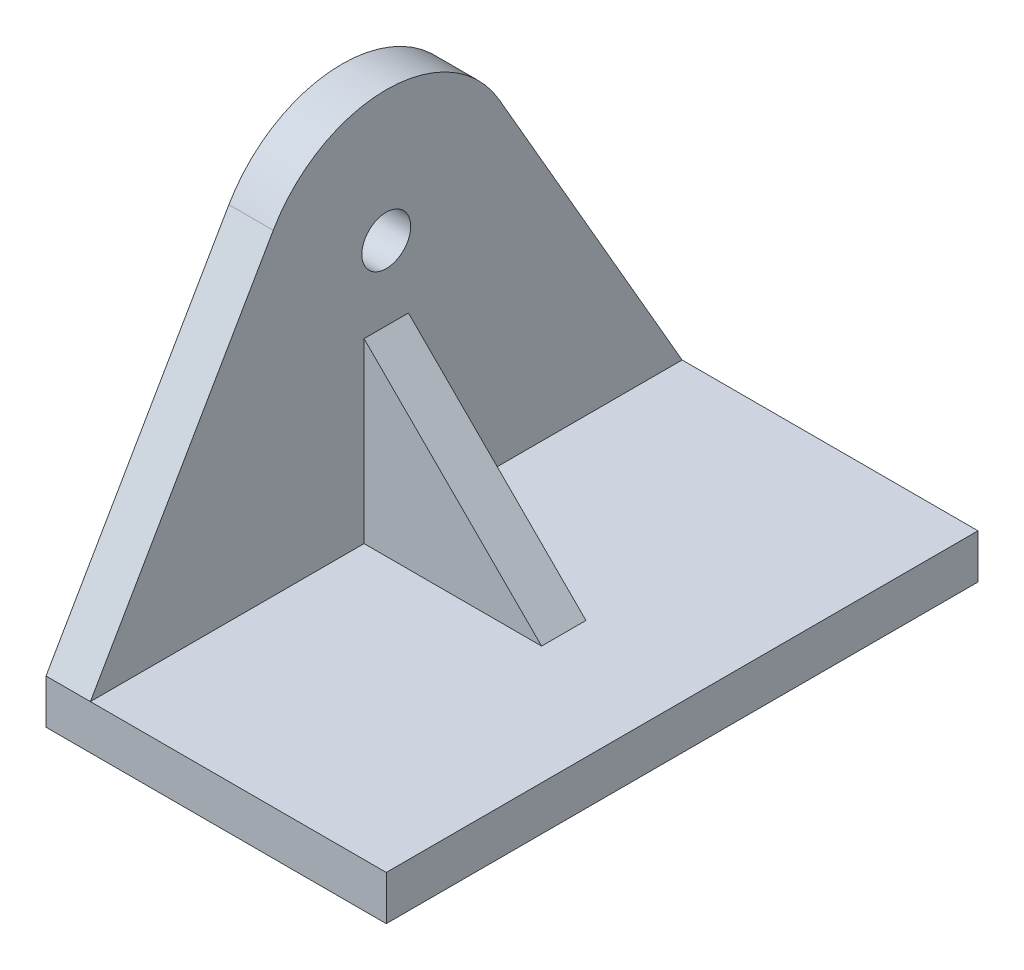
ISO-10303-21;
HEADER;
FILE_DESCRIPTION(('STEP AP214'),'2;1');
FILE_NAME('part.step','',(''),(''),'','','');
FILE_SCHEMA(('AUTOMOTIVE_DESIGN { 1 0 10303 214 1 1 1 1 }'));
ENDSEC;
DATA;
#1=APPLICATION_CONTEXT('core data for automotive mechanical design processes');
#2=APPLICATION_PROTOCOL_DEFINITION('international standard','automotive_design',2000,#1);
#3=PRODUCT_CONTEXT('',#1,'mechanical');
#4=PRODUCT('Part','Part','',(#3));
#5=PRODUCT_RELATED_PRODUCT_CATEGORY('part','',(#4));
#6=PRODUCT_DEFINITION_FORMATION('','',#4);
#7=PRODUCT_DEFINITION_CONTEXT('part definition',#1,'design');
#8=PRODUCT_DEFINITION('design','',#6,#7);
#9=PRODUCT_DEFINITION_SHAPE('','',#8);
#10=(LENGTH_UNIT() NAMED_UNIT(*) SI_UNIT(.MILLI.,.METRE.));
#11=(NAMED_UNIT(*) PLANE_ANGLE_UNIT() SI_UNIT($,.RADIAN.));
#12=(NAMED_UNIT(*) SI_UNIT($,.STERADIAN.) SOLID_ANGLE_UNIT());
#13=UNCERTAINTY_MEASURE_WITH_UNIT(LENGTH_MEASURE(1.E-05),#10,'distance_accuracy_value','');
#14=(GEOMETRIC_REPRESENTATION_CONTEXT(3) GLOBAL_UNCERTAINTY_ASSIGNED_CONTEXT((#13)) GLOBAL_UNIT_ASSIGNED_CONTEXT((#10,
#11,#12)) REPRESENTATION_CONTEXT('',''));
#15=CARTESIAN_POINT('',(0.,0.,0.));
#16=DIRECTION('',(0.,0.,1.));
#17=DIRECTION('',(1.,0.,0.));
#18=AXIS2_PLACEMENT_3D('',#15,#16,#17);
#19=CARTESIAN_POINT('',(0.,20.,0.));
#20=DIRECTION('',(1.,0.,0.));
#21=DIRECTION('',(0.,0.,-1.));
#22=AXIS2_PLACEMENT_3D('',#19,#20,#21);
#23=PLANE('',#22);
#24=CARTESIAN_POINT('',(0.,20.,0.));
#25=DIRECTION('',(1.,0.,0.));
#26=DIRECTION('',(0.,0.,-1.));
#27=AXIS2_PLACEMENT_3D('',#24,#25,#26);
#28=CIRCLE('',#27,1.65);
#29=CARTESIAN_POINT('',(0.,20.,-1.65));
#30=VERTEX_POINT('',#29);
#31=EDGE_CURVE('E195',#30,#30,#28,.T.);
#32=ORIENTED_EDGE('',*,*,#31,.F.);
#33=EDGE_LOOP('',(#32));
#34=FACE_BOUND('',#33,.T.);
#35=DIRECTION('',(0.,0.,1.));
#36=VECTOR('',#35,1.);
#37=CARTESIAN_POINT('',(0.,3.,20.));
#38=LINE('',#37,#36);
#39=CARTESIAN_POINT('',(0.,3.,1.5));
#40=VERTEX_POINT('',#39);
#41=CARTESIAN_POINT('',(0.,3.,20.));
#42=VERTEX_POINT('',#41);
#43=EDGE_CURVE('E179',#40,#42,#38,.T.);
#44=ORIENTED_EDGE('',*,*,#43,.F.);
#45=DIRECTION('',(0.,-1.,0.));
#46=VECTOR('',#45,1.);
#47=CARTESIAN_POINT('',(0.,3.,1.5));
#48=LINE('',#47,#46);
#49=CARTESIAN_POINT('',(0.,15.,1.5));
#50=VERTEX_POINT('',#49);
#51=EDGE_CURVE('E232',#50,#40,#48,.T.);
#52=ORIENTED_EDGE('',*,*,#51,.F.);
#53=DIRECTION('',(0.,0.,-1.));
#54=VECTOR('',#53,1.);
#55=CARTESIAN_POINT('',(0.,15.,1.5));
#56=LINE('',#55,#54);
#57=CARTESIAN_POINT('',(0.,15.,-1.5));
#58=VERTEX_POINT('',#57);
#59=EDGE_CURVE('E228',#50,#58,#56,.T.);
#60=ORIENTED_EDGE('',*,*,#59,.T.);
#61=DIRECTION('',(0.,-1.,0.));
#62=VECTOR('',#61,1.);
#63=CARTESIAN_POINT('',(0.,3.,-1.5));
#64=LINE('',#63,#62);
#65=CARTESIAN_POINT('',(0.,3.,-1.5));
#66=VERTEX_POINT('',#65);
#67=EDGE_CURVE('E241',#58,#66,#64,.T.);
#68=ORIENTED_EDGE('',*,*,#67,.T.);
#69=CARTESIAN_POINT('',(0.,3.,-20.));
#70=VERTEX_POINT('',#69);
#71=EDGE_CURVE('E175',#70,#66,#38,.T.);
#72=ORIENTED_EDGE('',*,*,#71,.F.);
#73=DIRECTION('',(0.,0.86602540378444,0.499999999999998));
#74=VECTOR('',#73,1.);
#75=CARTESIAN_POINT('',(0.,3.,-20.));
#76=LINE('',#75,#74);
#77=CARTESIAN_POINT('',(0.,24.4102540378444,-7.63878406783236));
#78=VERTEX_POINT('',#77);
#79=EDGE_CURVE('E136',#70,#78,#76,.T.);
#80=ORIENTED_EDGE('',*,*,#79,.T.);
#81=CARTESIAN_POINT('',(0.,20.,0.));
#82=DIRECTION('',(1.,0.,0.));
#83=DIRECTION('',(0.,0.,-1.));
#84=AXIS2_PLACEMENT_3D('',#81,#82,#83);
#85=CIRCLE('',#84,8.82050807568884);
#86=CARTESIAN_POINT('',(0.,24.4102540378444,7.63878406783234));
#87=VERTEX_POINT('',#86);
#88=EDGE_CURVE('E106',#78,#87,#85,.T.);
#89=ORIENTED_EDGE('',*,*,#88,.T.);
#90=DIRECTION('',(0.,-0.86602540378444,0.499999999999998));
#91=VECTOR('',#90,1.);
#92=CARTESIAN_POINT('',(0.,3.,20.));
#93=LINE('',#92,#91);
#94=EDGE_CURVE('E142',#87,#42,#93,.T.);
#95=ORIENTED_EDGE('',*,*,#94,.T.);
#96=EDGE_LOOP('',(#44,#52,#60,#68,#72,#80,#89,#95));
#97=FACE_BOUND('',#96,.T.);
#98=ADVANCED_FACE('F39',(#34,#97),#23,.T.);
#99=CARTESIAN_POINT('',(20.,3.,20.));
#100=DIRECTION('',(0.,-1.,0.));
#101=DIRECTION('',(0.,0.,-1.));
#102=AXIS2_PLACEMENT_3D('',#99,#100,#101);
#103=PLANE('',#102);
#104=DIRECTION('',(1.,0.,0.));
#105=VECTOR('',#104,1.);
#106=CARTESIAN_POINT('',(12.,3.,1.5));
#107=LINE('',#106,#105);
#108=CARTESIAN_POINT('',(12.,3.,1.5));
#109=VERTEX_POINT('',#108);
#110=EDGE_CURVE('E233',#40,#109,#107,.T.);
#111=ORIENTED_EDGE('',*,*,#110,.F.);
#112=ORIENTED_EDGE('',*,*,#43,.T.);
#113=DIRECTION('',(-1.,0.,0.));
#114=VECTOR('',#113,1.);
#115=CARTESIAN_POINT('',(20.,3.,20.));
#116=LINE('',#115,#114);
#117=CARTESIAN_POINT('',(20.,3.,20.));
#118=VERTEX_POINT('',#117);
#119=EDGE_CURVE('E187',#118,#42,#116,.T.);
#120=ORIENTED_EDGE('',*,*,#119,.F.);
#121=DIRECTION('',(0.,0.,1.));
#122=VECTOR('',#121,1.);
#123=CARTESIAN_POINT('',(20.,3.,20.));
#124=LINE('',#123,#122);
#125=CARTESIAN_POINT('',(20.,3.,-20.));
#126=VERTEX_POINT('',#125);
#127=EDGE_CURVE('E172',#126,#118,#124,.T.);
#128=ORIENTED_EDGE('',*,*,#127,.F.);
#129=DIRECTION('',(-1.,0.,0.));
#130=VECTOR('',#129,1.);
#131=CARTESIAN_POINT('',(20.,3.,-20.));
#132=LINE('',#131,#130);
#133=EDGE_CURVE('E191',#126,#70,#132,.T.);
#134=ORIENTED_EDGE('',*,*,#133,.T.);
#135=ORIENTED_EDGE('',*,*,#71,.T.);
#136=DIRECTION('',(1.,0.,0.));
#137=VECTOR('',#136,1.);
#138=CARTESIAN_POINT('',(12.,3.,-1.5));
#139=LINE('',#138,#137);
#140=CARTESIAN_POINT('',(12.,3.,-1.5));
#141=VERTEX_POINT('',#140);
#142=EDGE_CURVE('E245',#66,#141,#139,.T.);
#143=ORIENTED_EDGE('',*,*,#142,.T.);
#144=DIRECTION('',(0.,0.,-1.));
#145=VECTOR('',#144,1.);
#146=CARTESIAN_POINT('',(12.,3.,1.5));
#147=LINE('',#146,#145);
#148=EDGE_CURVE('E57',#109,#141,#147,.T.);
#149=ORIENTED_EDGE('',*,*,#148,.F.);
#150=EDGE_LOOP('',(#111,#112,#120,#128,#134,#135,#143,#149));
#151=FACE_BOUND('',#150,.T.);
#152=ADVANCED_FACE('F244',(#151),#103,.F.);
#153=CARTESIAN_POINT('',(-3.,0.,20.));
#154=DIRECTION('',(0.,0.,1.));
#155=DIRECTION('',(1.,0.,0.));
#156=AXIS2_PLACEMENT_3D('',#153,#154,#155);
#157=PLANE('',#156);
#158=DIRECTION('',(1.,0.,0.));
#159=VECTOR('',#158,1.);
#160=CARTESIAN_POINT('',(-3.,0.,20.));
#161=LINE('',#160,#159);
#162=CARTESIAN_POINT('',(-3.,0.,20.));
#163=VERTEX_POINT('',#162);
#164=CARTESIAN_POINT('',(20.,0.,20.));
#165=VERTEX_POINT('',#164);
#166=EDGE_CURVE('E43',#163,#165,#161,.T.);
#167=ORIENTED_EDGE('',*,*,#166,.T.);
#168=DIRECTION('',(0.,-1.,0.));
#169=VECTOR('',#168,1.);
#170=CARTESIAN_POINT('',(20.,3.,20.));
#171=LINE('',#170,#169);
#172=EDGE_CURVE('E159',#118,#165,#171,.T.);
#173=ORIENTED_EDGE('',*,*,#172,.F.);
#174=ORIENTED_EDGE('',*,*,#119,.T.);
#175=DIRECTION('',(1.,0.,0.));
#176=VECTOR('',#175,1.);
#177=CARTESIAN_POINT('',(-3.,3.,20.));
#178=LINE('',#177,#176);
#179=CARTESIAN_POINT('',(-3.,3.,20.));
#180=VERTEX_POINT('',#179);
#181=EDGE_CURVE('E11',#180,#42,#178,.T.);
#182=ORIENTED_EDGE('',*,*,#181,.F.);
#183=DIRECTION('',(0.,-1.,0.));
#184=VECTOR('',#183,1.);
#185=CARTESIAN_POINT('',(-3.,0.,20.));
#186=LINE('',#185,#184);
#187=EDGE_CURVE('E145',#180,#163,#186,.T.);
#188=ORIENTED_EDGE('',*,*,#187,.T.);
#189=EDGE_LOOP('',(#167,#173,#174,#182,#188));
#190=FACE_BOUND('',#189,.T.);
#191=ADVANCED_FACE('F41',(#190),#157,.T.);
#192=CARTESIAN_POINT('',(-3.,3.,20.));
#193=DIRECTION('',(0.,0.499999999999998,0.86602540378444));
#194=DIRECTION('',(0.,-0.86602540378444,0.499999999999998));
#195=AXIS2_PLACEMENT_3D('',#192,#193,#194);
#196=PLANE('',#195);
#197=ORIENTED_EDGE('',*,*,#94,.F.);
#198=DIRECTION('',(1.,0.,0.));
#199=VECTOR('',#198,1.);
#200=CARTESIAN_POINT('',(-3.,24.4102540378444,7.63878406783234));
#201=LINE('',#200,#199);
#202=CARTESIAN_POINT('',(-3.,24.4102540378444,7.63878406783234));
#203=VERTEX_POINT('',#202);
#204=EDGE_CURVE('E49',#203,#87,#201,.T.);
#205=ORIENTED_EDGE('',*,*,#204,.F.);
#206=DIRECTION('',(0.,-0.86602540378444,0.499999999999998));
#207=VECTOR('',#206,1.);
#208=CARTESIAN_POINT('',(-3.,3.,20.));
#209=LINE('',#208,#207);
#210=EDGE_CURVE('E121',#203,#180,#209,.T.);
#211=ORIENTED_EDGE('',*,*,#210,.T.);
#212=ORIENTED_EDGE('',*,*,#181,.T.);
#213=EDGE_LOOP('',(#197,#205,#211,#212));
#214=FACE_BOUND('',#213,.T.);
#215=ADVANCED_FACE('F265',(#214),#196,.T.);
#216=CARTESIAN_POINT('',(-3.,20.,0.));
#217=DIRECTION('',(1.,0.,0.));
#218=DIRECTION('',(0.,0.,-1.));
#219=AXIS2_PLACEMENT_3D('',#216,#217,#218);
#220=CYLINDRICAL_SURFACE('',#219,8.82050807568884);
#221=ORIENTED_EDGE('',*,*,#88,.F.);
#222=DIRECTION('',(1.,0.,0.));
#223=VECTOR('',#222,1.);
#224=CARTESIAN_POINT('',(-3.,24.4102540378444,-7.63878406783236));
#225=LINE('',#224,#223);
#226=CARTESIAN_POINT('',(-3.,24.4102540378444,-7.63878406783236));
#227=VERTEX_POINT('',#226);
#228=EDGE_CURVE('E101',#227,#78,#225,.T.);
#229=ORIENTED_EDGE('',*,*,#228,.F.);
#230=CARTESIAN_POINT('',(-3.,20.,0.));
#231=DIRECTION('',(1.,0.,0.));
#232=DIRECTION('',(0.,0.,-1.));
#233=AXIS2_PLACEMENT_3D('',#230,#231,#232);
#234=CIRCLE('',#233,8.82050807568884);
#235=EDGE_CURVE('E104',#227,#203,#234,.T.);
#236=ORIENTED_EDGE('',*,*,#235,.T.);
#237=ORIENTED_EDGE('',*,*,#204,.T.);
#238=EDGE_LOOP('',(#221,#229,#236,#237));
#239=FACE_BOUND('',#238,.T.);
#240=ADVANCED_FACE('F103',(#239),#220,.T.);
#241=CARTESIAN_POINT('',(-3.,3.,-20.));
#242=DIRECTION('',(0.,0.499999999999998,-0.86602540378444));
#243=DIRECTION('',(0.,0.86602540378444,0.499999999999998));
#244=AXIS2_PLACEMENT_3D('',#241,#242,#243);
#245=PLANE('',#244);
#246=ORIENTED_EDGE('',*,*,#79,.F.);
#247=DIRECTION('',(1.,0.,0.));
#248=VECTOR('',#247,1.);
#249=CARTESIAN_POINT('',(-3.,3.,-20.));
#250=LINE('',#249,#248);
#251=CARTESIAN_POINT('',(-3.,3.,-20.));
#252=VERTEX_POINT('',#251);
#253=EDGE_CURVE('E112',#252,#70,#250,.T.);
#254=ORIENTED_EDGE('',*,*,#253,.F.);
#255=DIRECTION('',(0.,0.86602540378444,0.499999999999998));
#256=VECTOR('',#255,1.);
#257=CARTESIAN_POINT('',(-3.,3.,-20.));
#258=LINE('',#257,#256);
#259=EDGE_CURVE('E118',#252,#227,#258,.T.);
#260=ORIENTED_EDGE('',*,*,#259,.T.);
#261=ORIENTED_EDGE('',*,*,#228,.T.);
#262=EDGE_LOOP('',(#246,#254,#260,#261));
#263=FACE_BOUND('',#262,.T.);
#264=ADVANCED_FACE('F124',(#263),#245,.T.);
#265=CARTESIAN_POINT('',(-3.,0.,-20.));
#266=DIRECTION('',(0.,0.,-1.));
#267=DIRECTION('',(-1.,0.,0.));
#268=AXIS2_PLACEMENT_3D('',#265,#266,#267);
#269=PLANE('',#268);
#270=ORIENTED_EDGE('',*,*,#253,.T.);
#271=ORIENTED_EDGE('',*,*,#133,.F.);
#272=DIRECTION('',(0.,1.,0.));
#273=VECTOR('',#272,1.);
#274=CARTESIAN_POINT('',(20.,3.,-20.));
#275=LINE('',#274,#273);
#276=CARTESIAN_POINT('',(20.,0.,-20.));
#277=VERTEX_POINT('',#276);
#278=EDGE_CURVE('E167',#277,#126,#275,.T.);
#279=ORIENTED_EDGE('',*,*,#278,.F.);
#280=DIRECTION('',(1.,0.,0.));
#281=VECTOR('',#280,1.);
#282=CARTESIAN_POINT('',(-3.,0.,-20.));
#283=LINE('',#282,#281);
#284=CARTESIAN_POINT('',(-3.,0.,-20.));
#285=VERTEX_POINT('',#284);
#286=EDGE_CURVE('E150',#285,#277,#283,.T.);
#287=ORIENTED_EDGE('',*,*,#286,.F.);
#288=DIRECTION('',(0.,1.,0.));
#289=VECTOR('',#288,1.);
#290=CARTESIAN_POINT('',(-3.,0.,-20.));
#291=LINE('',#290,#289);
#292=EDGE_CURVE('E127',#285,#252,#291,.T.);
#293=ORIENTED_EDGE('',*,*,#292,.T.);
#294=EDGE_LOOP('',(#270,#271,#279,#287,#293));
#295=FACE_BOUND('',#294,.T.);
#296=ADVANCED_FACE('F205',(#295),#269,.T.);
#297=CARTESIAN_POINT('',(-3.,0.,20.));
#298=DIRECTION('',(0.,-1.,0.));
#299=DIRECTION('',(0.,0.,-1.));
#300=AXIS2_PLACEMENT_3D('',#297,#298,#299);
#301=PLANE('',#300);
#302=ORIENTED_EDGE('',*,*,#286,.T.);
#303=DIRECTION('',(0.,0.,-1.));
#304=VECTOR('',#303,1.);
#305=CARTESIAN_POINT('',(20.,0.,20.));
#306=LINE('',#305,#304);
#307=EDGE_CURVE('E161',#165,#277,#306,.T.);
#308=ORIENTED_EDGE('',*,*,#307,.F.);
#309=ORIENTED_EDGE('',*,*,#166,.F.);
#310=DIRECTION('',(0.,0.,-1.));
#311=VECTOR('',#310,1.);
#312=CARTESIAN_POINT('',(-3.,0.,20.));
#313=LINE('',#312,#311);
#314=EDGE_CURVE('E130',#163,#285,#313,.T.);
#315=ORIENTED_EDGE('',*,*,#314,.T.);
#316=EDGE_LOOP('',(#302,#308,#309,#315));
#317=FACE_BOUND('',#316,.T.);
#318=ADVANCED_FACE('F162',(#317),#301,.T.);
#319=CARTESIAN_POINT('',(-3.,20.,0.));
#320=DIRECTION('',(1.,0.,0.));
#321=DIRECTION('',(0.,0.,-1.));
#322=AXIS2_PLACEMENT_3D('',#319,#320,#321);
#323=PLANE('',#322);
#324=CARTESIAN_POINT('',(-3.,20.,0.));
#325=DIRECTION('',(1.,0.,0.));
#326=DIRECTION('',(0.,0.,-1.));
#327=AXIS2_PLACEMENT_3D('',#324,#325,#326);
#328=CIRCLE('',#327,1.65);
#329=CARTESIAN_POINT('',(-3.,20.,-1.65));
#330=VERTEX_POINT('',#329);
#331=EDGE_CURVE('E139',#330,#330,#328,.T.);
#332=ORIENTED_EDGE('',*,*,#331,.T.);
#333=EDGE_LOOP('',(#332));
#334=FACE_BOUND('',#333,.T.);
#335=ORIENTED_EDGE('',*,*,#187,.F.);
#336=ORIENTED_EDGE('',*,*,#210,.F.);
#337=ORIENTED_EDGE('',*,*,#235,.F.);
#338=ORIENTED_EDGE('',*,*,#259,.F.);
#339=ORIENTED_EDGE('',*,*,#292,.F.);
#340=ORIENTED_EDGE('',*,*,#314,.F.);
#341=EDGE_LOOP('',(#335,#336,#337,#338,#339,#340));
#342=FACE_BOUND('',#341,.T.);
#343=ADVANCED_FACE('F116',(#334,#342),#323,.F.);
#344=CARTESIAN_POINT('',(-3.,20.,0.));
#345=DIRECTION('',(1.,0.,0.));
#346=DIRECTION('',(0.,0.,-1.));
#347=AXIS2_PLACEMENT_3D('',#344,#345,#346);
#348=CYLINDRICAL_SURFACE('',#347,1.65);
#349=ORIENTED_EDGE('',*,*,#331,.F.);
#350=EDGE_LOOP('',(#349));
#351=FACE_BOUND('',#350,.T.);
#352=ORIENTED_EDGE('',*,*,#31,.T.);
#353=EDGE_LOOP('',(#352));
#354=FACE_BOUND('',#353,.T.);
#355=ADVANCED_FACE('F284',(#351,#354),#348,.F.);
#356=CARTESIAN_POINT('',(20.,0.,0.));
#357=DIRECTION('',(1.,0.,0.));
#358=DIRECTION('',(0.,0.,-1.));
#359=AXIS2_PLACEMENT_3D('',#356,#357,#358);
#360=PLANE('',#359);
#361=ORIENTED_EDGE('',*,*,#172,.T.);
#362=ORIENTED_EDGE('',*,*,#307,.T.);
#363=ORIENTED_EDGE('',*,*,#278,.T.);
#364=ORIENTED_EDGE('',*,*,#127,.T.);
#365=EDGE_LOOP('',(#361,#362,#363,#364));
#366=FACE_BOUND('',#365,.T.);
#367=ADVANCED_FACE('F170',(#366),#360,.T.);
#368=CARTESIAN_POINT('',(0.,15.,1.5));
#369=DIRECTION('',(-0.707106781186547,-0.707106781186548,0.));
#370=DIRECTION('',(0.707106781186548,-0.707106781186547,0.));
#371=AXIS2_PLACEMENT_3D('',#368,#369,#370);
#372=PLANE('',#371);
#373=DIRECTION('',(-0.707106781186548,0.707106781186547,0.));
#374=VECTOR('',#373,1.);
#375=CARTESIAN_POINT('',(0.,15.,-1.5));
#376=LINE('',#375,#374);
#377=EDGE_CURVE('E256',#141,#58,#376,.T.);
#378=ORIENTED_EDGE('',*,*,#377,.T.);
#379=ORIENTED_EDGE('',*,*,#59,.F.);
#380=DIRECTION('',(-0.707106781186548,0.707106781186547,0.));
#381=VECTOR('',#380,1.);
#382=CARTESIAN_POINT('',(0.,15.,1.5));
#383=LINE('',#382,#381);
#384=EDGE_CURVE('E224',#109,#50,#383,.T.);
#385=ORIENTED_EDGE('',*,*,#384,.F.);
#386=ORIENTED_EDGE('',*,*,#148,.T.);
#387=EDGE_LOOP('',(#378,#379,#385,#386));
#388=FACE_BOUND('',#387,.T.);
#389=ADVANCED_FACE('F226',(#388),#372,.F.);
#390=CARTESIAN_POINT('',(0.,0.,1.5));
#391=DIRECTION('',(0.,0.,-1.));
#392=DIRECTION('',(-1.,0.,0.));
#393=AXIS2_PLACEMENT_3D('',#390,#391,#392);
#394=PLANE('',#393);
#395=ORIENTED_EDGE('',*,*,#110,.T.);
#396=ORIENTED_EDGE('',*,*,#384,.T.);
#397=ORIENTED_EDGE('',*,*,#51,.T.);
#398=EDGE_LOOP('',(#395,#396,#397));
#399=FACE_BOUND('',#398,.T.);
#400=ADVANCED_FACE('F236',(#399),#394,.F.);
#401=CARTESIAN_POINT('',(0.,0.,-1.5));
#402=DIRECTION('',(0.,0.,-1.));
#403=DIRECTION('',(-1.,0.,0.));
#404=AXIS2_PLACEMENT_3D('',#401,#402,#403);
#405=PLANE('',#404);
#406=ORIENTED_EDGE('',*,*,#142,.F.);
#407=ORIENTED_EDGE('',*,*,#67,.F.);
#408=ORIENTED_EDGE('',*,*,#377,.F.);
#409=EDGE_LOOP('',(#406,#407,#408));
#410=FACE_BOUND('',#409,.T.);
#411=ADVANCED_FACE('F262',(#410),#405,.T.);
#412=CLOSED_SHELL('',(#98,#152,#191,#215,#240,#264,#296,#318,#343,#355,#367,#389,#400,#411));
#413=MANIFOLD_SOLID_BREP('B2',#412);
#414=ADVANCED_BREP_SHAPE_REPRESENTATION('',(#18,#413),#14);
#415=SHAPE_DEFINITION_REPRESENTATION(#9,#414);
ENDSEC;
END-ISO-10303-21;
